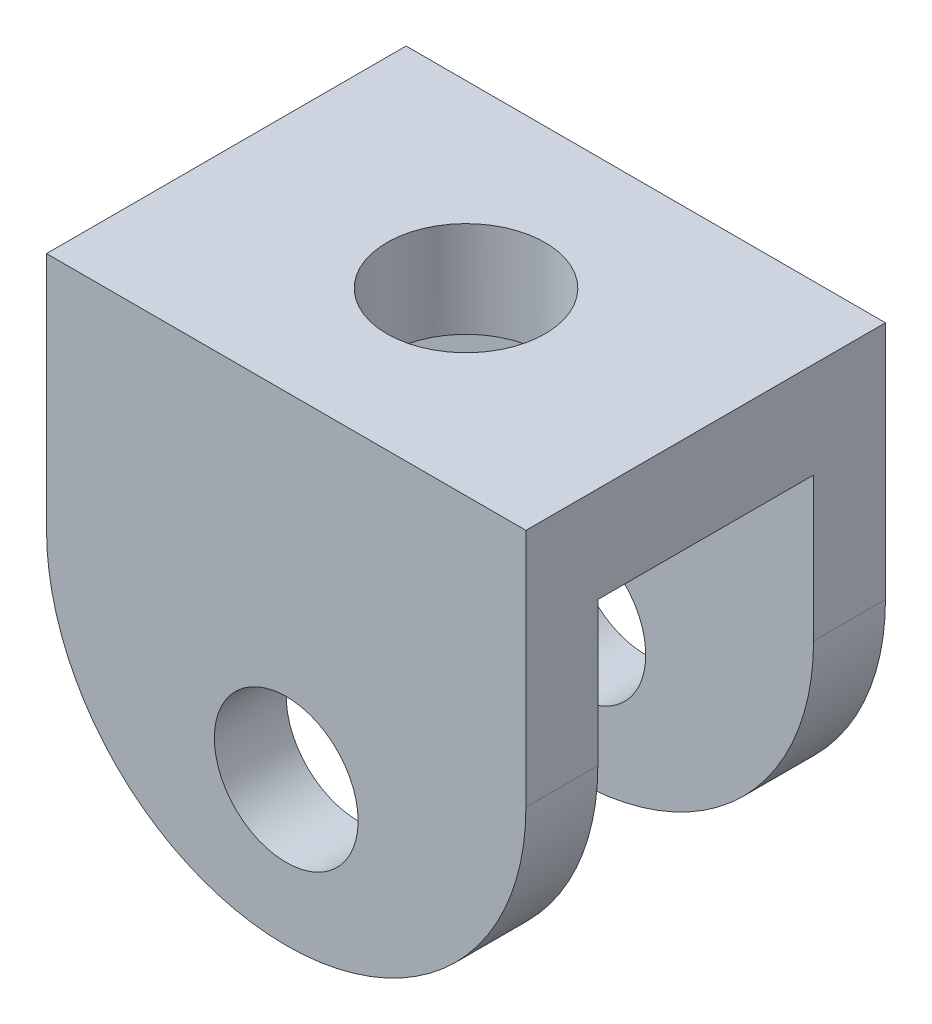
ISO-10303-21;
HEADER;
FILE_DESCRIPTION(('STEP AP214'),'2;1');
FILE_NAME('part.step','',(''),(''),'','','');
FILE_SCHEMA(('AUTOMOTIVE_DESIGN { 1 0 10303 214 1 1 1 1 }'));
ENDSEC;
DATA;
#1=APPLICATION_CONTEXT('core data for automotive mechanical design processes');
#2=APPLICATION_PROTOCOL_DEFINITION('international standard','automotive_design',2000,#1);
#3=PRODUCT_CONTEXT('',#1,'mechanical');
#4=PRODUCT('Part','Part','',(#3));
#5=PRODUCT_RELATED_PRODUCT_CATEGORY('part','',(#4));
#6=PRODUCT_DEFINITION_FORMATION('','',#4);
#7=PRODUCT_DEFINITION_CONTEXT('part definition',#1,'design');
#8=PRODUCT_DEFINITION('design','',#6,#7);
#9=PRODUCT_DEFINITION_SHAPE('','',#8);
#10=(LENGTH_UNIT() NAMED_UNIT(*) SI_UNIT(.MILLI.,.METRE.));
#11=(NAMED_UNIT(*) PLANE_ANGLE_UNIT() SI_UNIT($,.RADIAN.));
#12=(NAMED_UNIT(*) SI_UNIT($,.STERADIAN.) SOLID_ANGLE_UNIT());
#13=UNCERTAINTY_MEASURE_WITH_UNIT(LENGTH_MEASURE(1.E-05),#10,'distance_accuracy_value','');
#14=(GEOMETRIC_REPRESENTATION_CONTEXT(3) GLOBAL_UNCERTAINTY_ASSIGNED_CONTEXT((#13)) GLOBAL_UNIT_ASSIGNED_CONTEXT((#10,
#11,#12)) REPRESENTATION_CONTEXT('',''));
#15=CARTESIAN_POINT('',(0.,0.,0.));
#16=DIRECTION('',(0.,0.,1.));
#17=DIRECTION('',(1.,0.,0.));
#18=AXIS2_PLACEMENT_3D('',#15,#16,#17);
#19=CARTESIAN_POINT('',(0.,0.,0.));
#20=DIRECTION('',(0.,-1.,0.));
#21=DIRECTION('',(0.,0.,-1.));
#22=AXIS2_PLACEMENT_3D('',#19,#20,#21);
#23=PLANE('',#22);
#24=CARTESIAN_POINT('',(0.,0.,0.));
#25=DIRECTION('',(0.,-1.,0.));
#26=DIRECTION('',(0.,0.,-1.));
#27=AXIS2_PLACEMENT_3D('',#24,#25,#26);
#28=CIRCLE('',#27,3.3);
#29=CARTESIAN_POINT('',(0.,0.,-3.3));
#30=VERTEX_POINT('',#29);
#31=EDGE_CURVE('E138',#30,#30,#28,.T.);
#32=ORIENTED_EDGE('',*,*,#31,.F.);
#33=EDGE_LOOP('',(#32));
#34=FACE_BOUND('',#33,.T.);
#35=DIRECTION('',(0.,0.,-1.));
#36=VECTOR('',#35,1.);
#37=CARTESIAN_POINT('',(10.,0.,7.5));
#38=LINE('',#37,#36);
#39=CARTESIAN_POINT('',(10.,0.,4.5));
#40=VERTEX_POINT('',#39);
#41=CARTESIAN_POINT('',(10.,0.,-4.5));
#42=VERTEX_POINT('',#41);
#43=EDGE_CURVE('E123',#40,#42,#38,.T.);
#44=ORIENTED_EDGE('',*,*,#43,.F.);
#45=DIRECTION('',(1.,0.,0.));
#46=VECTOR('',#45,1.);
#47=CARTESIAN_POINT('',(10.,0.,4.5));
#48=LINE('',#47,#46);
#49=CARTESIAN_POINT('',(-10.,0.,4.5));
#50=VERTEX_POINT('',#49);
#51=EDGE_CURVE('E130',#50,#40,#48,.T.);
#52=ORIENTED_EDGE('',*,*,#51,.F.);
#53=DIRECTION('',(0.,0.,1.));
#54=VECTOR('',#53,1.);
#55=CARTESIAN_POINT('',(-10.,0.,7.5));
#56=LINE('',#55,#54);
#57=CARTESIAN_POINT('',(-10.,0.,-4.5));
#58=VERTEX_POINT('',#57);
#59=EDGE_CURVE('E143',#58,#50,#56,.T.);
#60=ORIENTED_EDGE('',*,*,#59,.F.);
#61=DIRECTION('',(-1.,0.,0.));
#62=VECTOR('',#61,1.);
#63=CARTESIAN_POINT('',(-10.,0.,-4.5));
#64=LINE('',#63,#62);
#65=EDGE_CURVE('E141',#42,#58,#64,.T.);
#66=ORIENTED_EDGE('',*,*,#65,.F.);
#67=EDGE_LOOP('',(#44,#52,#60,#66));
#68=FACE_BOUND('',#67,.T.);
#69=ADVANCED_FACE('F41',(#34,#68),#23,.T.);
#70=CARTESIAN_POINT('',(10.,4.,7.5));
#71=DIRECTION('',(-1.,0.,0.));
#72=DIRECTION('',(0.,0.,1.));
#73=AXIS2_PLACEMENT_3D('',#70,#71,#72);
#74=PLANE('',#73);
#75=DIRECTION('',(0.,1.,0.));
#76=VECTOR('',#75,1.);
#77=CARTESIAN_POINT('',(10.,-16.,-4.5));
#78=LINE('',#77,#76);
#79=CARTESIAN_POINT('',(10.,-6.,-4.5));
#80=VERTEX_POINT('',#79);
#81=EDGE_CURVE('E144',#80,#42,#78,.T.);
#82=ORIENTED_EDGE('',*,*,#81,.F.);
#83=DIRECTION('',(0.,0.,1.));
#84=VECTOR('',#83,1.);
#85=CARTESIAN_POINT('',(10.,-6.,7.5));
#86=LINE('',#85,#84);
#87=CARTESIAN_POINT('',(10.,-6.,-7.5));
#88=VERTEX_POINT('',#87);
#89=EDGE_CURVE('E185',#80,#88,#86,.F.);
#90=ORIENTED_EDGE('',*,*,#89,.T.);
#91=DIRECTION('',(0.,-1.,0.));
#92=VECTOR('',#91,1.);
#93=CARTESIAN_POINT('',(10.,4.,-7.5));
#94=LINE('',#93,#92);
#95=CARTESIAN_POINT('',(10.,4.,-7.5));
#96=VERTEX_POINT('',#95);
#97=EDGE_CURVE('E167',#96,#88,#94,.T.);
#98=ORIENTED_EDGE('',*,*,#97,.F.);
#99=DIRECTION('',(0.,0.,-1.));
#100=VECTOR('',#99,1.);
#101=CARTESIAN_POINT('',(10.,4.,7.5));
#102=LINE('',#101,#100);
#103=CARTESIAN_POINT('',(10.,4.,7.5));
#104=VERTEX_POINT('',#103);
#105=EDGE_CURVE('E148',#104,#96,#102,.T.);
#106=ORIENTED_EDGE('',*,*,#105,.F.);
#107=DIRECTION('',(0.,-1.,0.));
#108=VECTOR('',#107,1.);
#109=CARTESIAN_POINT('',(10.,4.,7.5));
#110=LINE('',#109,#108);
#111=CARTESIAN_POINT('',(10.,-6.,7.5));
#112=VERTEX_POINT('',#111);
#113=EDGE_CURVE('E156',#104,#112,#110,.T.);
#114=ORIENTED_EDGE('',*,*,#113,.T.);
#115=DIRECTION('',(0.,0.,1.));
#116=VECTOR('',#115,1.);
#117=CARTESIAN_POINT('',(10.,-6.,7.5));
#118=LINE('',#117,#116);
#119=CARTESIAN_POINT('',(10.,-6.,4.5));
#120=VERTEX_POINT('',#119);
#121=EDGE_CURVE('E127',#112,#120,#118,.F.);
#122=ORIENTED_EDGE('',*,*,#121,.T.);
#123=DIRECTION('',(0.,1.,0.));
#124=VECTOR('',#123,1.);
#125=CARTESIAN_POINT('',(10.,-16.,4.5));
#126=LINE('',#125,#124);
#127=EDGE_CURVE('E118',#120,#40,#126,.T.);
#128=ORIENTED_EDGE('',*,*,#127,.T.);
#129=ORIENTED_EDGE('',*,*,#43,.T.);
#130=EDGE_LOOP('',(#82,#90,#98,#106,#114,#122,#128,#129));
#131=FACE_BOUND('',#130,.T.);
#132=ADVANCED_FACE('F121',(#131),#74,.F.);
#133=CARTESIAN_POINT('',(-10.,4.,-7.5));
#134=DIRECTION('',(0.,0.,1.));
#135=DIRECTION('',(1.,0.,0.));
#136=AXIS2_PLACEMENT_3D('',#133,#134,#135);
#137=PLANE('',#136);
#138=CARTESIAN_POINT('',(0.,-10.,-7.5));
#139=DIRECTION('',(0.,0.,1.));
#140=DIRECTION('',(1.,0.,0.));
#141=AXIS2_PLACEMENT_3D('',#138,#139,#140);
#142=CIRCLE('',#141,3.);
#143=CARTESIAN_POINT('',(3.,-10.,-7.5));
#144=VERTEX_POINT('',#143);
#145=EDGE_CURVE('E209',#144,#144,#142,.T.);
#146=ORIENTED_EDGE('',*,*,#145,.T.);
#147=EDGE_LOOP('',(#146));
#148=FACE_BOUND('',#147,.T.);
#149=ORIENTED_EDGE('',*,*,#97,.T.);
#150=CARTESIAN_POINT('',(0.,-6.,-7.5));
#151=DIRECTION('',(0.,0.,1.));
#152=DIRECTION('',(1.,0.,0.));
#153=AXIS2_PLACEMENT_3D('',#150,#151,#152);
#154=CIRCLE('',#153,10.);
#155=CARTESIAN_POINT('',(0.,-16.,-7.5));
#156=VERTEX_POINT('',#155);
#157=EDGE_CURVE('E192',#88,#156,#154,.F.);
#158=ORIENTED_EDGE('',*,*,#157,.T.);
#159=CARTESIAN_POINT('',(0.,-6.,-7.5));
#160=DIRECTION('',(0.,0.,1.));
#161=DIRECTION('',(1.,0.,0.));
#162=AXIS2_PLACEMENT_3D('',#159,#160,#161);
#163=CIRCLE('',#162,10.);
#164=CARTESIAN_POINT('',(-10.,-6.,-7.5));
#165=VERTEX_POINT('',#164);
#166=EDGE_CURVE('E189',#156,#165,#163,.F.);
#167=ORIENTED_EDGE('',*,*,#166,.T.);
#168=DIRECTION('',(0.,-1.,0.));
#169=VECTOR('',#168,1.);
#170=CARTESIAN_POINT('',(-10.,4.,-7.5));
#171=LINE('',#170,#169);
#172=CARTESIAN_POINT('',(-10.,4.,-7.5));
#173=VERTEX_POINT('',#172);
#174=EDGE_CURVE('E163',#173,#165,#171,.T.);
#175=ORIENTED_EDGE('',*,*,#174,.F.);
#176=DIRECTION('',(-1.,0.,0.));
#177=VECTOR('',#176,1.);
#178=CARTESIAN_POINT('',(-10.,4.,-7.5));
#179=LINE('',#178,#177);
#180=EDGE_CURVE('E239',#96,#173,#179,.T.);
#181=ORIENTED_EDGE('',*,*,#180,.F.);
#182=EDGE_LOOP('',(#149,#158,#167,#175,#181));
#183=FACE_BOUND('',#182,.T.);
#184=ADVANCED_FACE('F278',(#148,#183),#137,.F.);
#185=CARTESIAN_POINT('',(-10.,4.,7.5));
#186=DIRECTION('',(1.,0.,0.));
#187=DIRECTION('',(0.,0.,-1.));
#188=AXIS2_PLACEMENT_3D('',#185,#186,#187);
#189=PLANE('',#188);
#190=DIRECTION('',(0.,1.,0.));
#191=VECTOR('',#190,1.);
#192=CARTESIAN_POINT('',(-10.,-16.,4.5));
#193=LINE('',#192,#191);
#194=CARTESIAN_POINT('',(-10.,-6.,4.5));
#195=VERTEX_POINT('',#194);
#196=EDGE_CURVE('E129',#195,#50,#193,.T.);
#197=ORIENTED_EDGE('',*,*,#196,.F.);
#198=DIRECTION('',(0.,0.,-1.));
#199=VECTOR('',#198,1.);
#200=CARTESIAN_POINT('',(-10.,-6.,7.5));
#201=LINE('',#200,#199);
#202=CARTESIAN_POINT('',(-10.,-6.,7.5));
#203=VERTEX_POINT('',#202);
#204=EDGE_CURVE('E11',#195,#203,#201,.F.);
#205=ORIENTED_EDGE('',*,*,#204,.T.);
#206=DIRECTION('',(0.,-1.,0.));
#207=VECTOR('',#206,1.);
#208=CARTESIAN_POINT('',(-10.,4.,7.5));
#209=LINE('',#208,#207);
#210=CARTESIAN_POINT('',(-10.,4.,7.5));
#211=VERTEX_POINT('',#210);
#212=EDGE_CURVE('E159',#211,#203,#209,.T.);
#213=ORIENTED_EDGE('',*,*,#212,.F.);
#214=DIRECTION('',(0.,0.,1.));
#215=VECTOR('',#214,1.);
#216=CARTESIAN_POINT('',(-10.,4.,7.5));
#217=LINE('',#216,#215);
#218=EDGE_CURVE('E237',#173,#211,#217,.T.);
#219=ORIENTED_EDGE('',*,*,#218,.F.);
#220=ORIENTED_EDGE('',*,*,#174,.T.);
#221=DIRECTION('',(0.,0.,-1.));
#222=VECTOR('',#221,1.);
#223=CARTESIAN_POINT('',(-10.,-6.,7.5));
#224=LINE('',#223,#222);
#225=CARTESIAN_POINT('',(-10.,-6.,-4.5));
#226=VERTEX_POINT('',#225);
#227=EDGE_CURVE('E51',#165,#226,#224,.F.);
#228=ORIENTED_EDGE('',*,*,#227,.T.);
#229=DIRECTION('',(0.,1.,0.));
#230=VECTOR('',#229,1.);
#231=CARTESIAN_POINT('',(-10.,-16.,-4.5));
#232=LINE('',#231,#230);
#233=EDGE_CURVE('E150',#226,#58,#232,.T.);
#234=ORIENTED_EDGE('',*,*,#233,.T.);
#235=ORIENTED_EDGE('',*,*,#59,.T.);
#236=EDGE_LOOP('',(#197,#205,#213,#219,#220,#228,#234,#235));
#237=FACE_BOUND('',#236,.T.);
#238=ADVANCED_FACE('F227',(#237),#189,.F.);
#239=CARTESIAN_POINT('',(-10.,4.,7.5));
#240=DIRECTION('',(0.,0.,-1.));
#241=DIRECTION('',(-1.,0.,0.));
#242=AXIS2_PLACEMENT_3D('',#239,#240,#241);
#243=PLANE('',#242);
#244=CARTESIAN_POINT('',(0.,-10.,7.5));
#245=DIRECTION('',(0.,0.,1.));
#246=DIRECTION('',(1.,0.,0.));
#247=AXIS2_PLACEMENT_3D('',#244,#245,#246);
#248=CIRCLE('',#247,3.);
#249=CARTESIAN_POINT('',(3.,-10.,7.5));
#250=VERTEX_POINT('',#249);
#251=EDGE_CURVE('E177',#250,#250,#248,.T.);
#252=ORIENTED_EDGE('',*,*,#251,.F.);
#253=EDGE_LOOP('',(#252));
#254=FACE_BOUND('',#253,.T.);
#255=CARTESIAN_POINT('',(0.,-6.,7.5));
#256=DIRECTION('',(0.,0.,-1.));
#257=DIRECTION('',(-1.,0.,0.));
#258=AXIS2_PLACEMENT_3D('',#255,#256,#257);
#259=CIRCLE('',#258,10.);
#260=CARTESIAN_POINT('',(0.,-16.,7.5));
#261=VERTEX_POINT('',#260);
#262=EDGE_CURVE('E195',#203,#261,#259,.F.);
#263=ORIENTED_EDGE('',*,*,#262,.T.);
#264=CARTESIAN_POINT('',(0.,-6.,7.5));
#265=DIRECTION('',(0.,0.,-1.));
#266=DIRECTION('',(-1.,0.,0.));
#267=AXIS2_PLACEMENT_3D('',#264,#265,#266);
#268=CIRCLE('',#267,10.);
#269=EDGE_CURVE('E198',#261,#112,#268,.F.);
#270=ORIENTED_EDGE('',*,*,#269,.T.);
#271=ORIENTED_EDGE('',*,*,#113,.F.);
#272=DIRECTION('',(1.,0.,0.));
#273=VECTOR('',#272,1.);
#274=CARTESIAN_POINT('',(-10.,4.,7.5));
#275=LINE('',#274,#273);
#276=EDGE_CURVE('E153',#211,#104,#275,.T.);
#277=ORIENTED_EDGE('',*,*,#276,.F.);
#278=ORIENTED_EDGE('',*,*,#212,.T.);
#279=EDGE_LOOP('',(#263,#270,#271,#277,#278));
#280=FACE_BOUND('',#279,.T.);
#281=ADVANCED_FACE('F231',(#254,#280),#243,.F.);
#282=CARTESIAN_POINT('',(0.,4.,0.));
#283=DIRECTION('',(0.,-1.,0.));
#284=DIRECTION('',(0.,0.,-1.));
#285=AXIS2_PLACEMENT_3D('',#282,#283,#284);
#286=PLANE('',#285);
#287=CARTESIAN_POINT('',(0.,4.,0.));
#288=DIRECTION('',(0.,1.,0.));
#289=DIRECTION('',(0.,0.,1.));
#290=AXIS2_PLACEMENT_3D('',#287,#288,#289);
#291=CIRCLE('',#290,3.3);
#292=CARTESIAN_POINT('',(0.,4.,3.3));
#293=VERTEX_POINT('',#292);
#294=EDGE_CURVE('E254',#293,#293,#291,.T.);
#295=ORIENTED_EDGE('',*,*,#294,.F.);
#296=EDGE_LOOP('',(#295));
#297=FACE_BOUND('',#296,.T.);
#298=ORIENTED_EDGE('',*,*,#105,.T.);
#299=ORIENTED_EDGE('',*,*,#180,.T.);
#300=ORIENTED_EDGE('',*,*,#218,.T.);
#301=ORIENTED_EDGE('',*,*,#276,.T.);
#302=EDGE_LOOP('',(#298,#299,#300,#301));
#303=FACE_BOUND('',#302,.T.);
#304=ADVANCED_FACE('F269',(#297,#303),#286,.F.);
#305=CARTESIAN_POINT('',(-10.,-16.,-4.5));
#306=DIRECTION('',(0.,0.,-1.));
#307=DIRECTION('',(-1.,0.,0.));
#308=AXIS2_PLACEMENT_3D('',#305,#306,#307);
#309=PLANE('',#308);
#310=CARTESIAN_POINT('',(0.,-10.,-4.5));
#311=DIRECTION('',(0.,0.,-1.));
#312=DIRECTION('',(-1.,0.,0.));
#313=AXIS2_PLACEMENT_3D('',#310,#311,#312);
#314=CIRCLE('',#313,3.);
#315=CARTESIAN_POINT('',(-3.,-10.,-4.5));
#316=VERTEX_POINT('',#315);
#317=EDGE_CURVE('E176',#316,#316,#314,.F.);
#318=ORIENTED_EDGE('',*,*,#317,.F.);
#319=EDGE_LOOP('',(#318));
#320=FACE_BOUND('',#319,.T.);
#321=CARTESIAN_POINT('',(0.,-6.,-4.5));
#322=DIRECTION('',(0.,0.,-1.));
#323=DIRECTION('',(-1.,0.,0.));
#324=AXIS2_PLACEMENT_3D('',#321,#322,#323);
#325=CIRCLE('',#324,10.);
#326=CARTESIAN_POINT('',(0.,-16.,-4.5));
#327=VERTEX_POINT('',#326);
#328=EDGE_CURVE('E171',#226,#327,#325,.F.);
#329=ORIENTED_EDGE('',*,*,#328,.T.);
#330=CARTESIAN_POINT('',(0.,-6.,-4.5));
#331=DIRECTION('',(0.,0.,-1.));
#332=DIRECTION('',(-1.,0.,0.));
#333=AXIS2_PLACEMENT_3D('',#330,#331,#332);
#334=CIRCLE('',#333,10.);
#335=EDGE_CURVE('E180',#327,#80,#334,.F.);
#336=ORIENTED_EDGE('',*,*,#335,.T.);
#337=ORIENTED_EDGE('',*,*,#81,.T.);
#338=ORIENTED_EDGE('',*,*,#65,.T.);
#339=ORIENTED_EDGE('',*,*,#233,.F.);
#340=EDGE_LOOP('',(#329,#336,#337,#338,#339));
#341=FACE_BOUND('',#340,.T.);
#342=ADVANCED_FACE('F275',(#320,#341),#309,.F.);
#343=CARTESIAN_POINT('',(10.,-16.,4.5));
#344=DIRECTION('',(0.,0.,1.));
#345=DIRECTION('',(1.,0.,0.));
#346=AXIS2_PLACEMENT_3D('',#343,#344,#345);
#347=PLANE('',#346);
#348=CARTESIAN_POINT('',(0.,-10.,4.5));
#349=DIRECTION('',(0.,0.,1.));
#350=DIRECTION('',(1.,0.,0.));
#351=AXIS2_PLACEMENT_3D('',#348,#349,#350);
#352=CIRCLE('',#351,3.);
#353=CARTESIAN_POINT('',(3.,-10.,4.5));
#354=VERTEX_POINT('',#353);
#355=EDGE_CURVE('E172',#354,#354,#352,.F.);
#356=ORIENTED_EDGE('',*,*,#355,.F.);
#357=EDGE_LOOP('',(#356));
#358=FACE_BOUND('',#357,.T.);
#359=ORIENTED_EDGE('',*,*,#127,.F.);
#360=CARTESIAN_POINT('',(0.,-6.,4.5));
#361=DIRECTION('',(0.,0.,1.));
#362=DIRECTION('',(1.,0.,0.));
#363=AXIS2_PLACEMENT_3D('',#360,#361,#362);
#364=CIRCLE('',#363,10.);
#365=CARTESIAN_POINT('',(0.,-16.,4.5));
#366=VERTEX_POINT('',#365);
#367=EDGE_CURVE('E64',#120,#366,#364,.F.);
#368=ORIENTED_EDGE('',*,*,#367,.T.);
#369=CARTESIAN_POINT('',(0.,-6.,4.5));
#370=DIRECTION('',(0.,0.,1.));
#371=DIRECTION('',(1.,0.,0.));
#372=AXIS2_PLACEMENT_3D('',#369,#370,#371);
#373=CIRCLE('',#372,10.);
#374=EDGE_CURVE('E59',#366,#195,#373,.F.);
#375=ORIENTED_EDGE('',*,*,#374,.T.);
#376=ORIENTED_EDGE('',*,*,#196,.T.);
#377=ORIENTED_EDGE('',*,*,#51,.T.);
#378=EDGE_LOOP('',(#359,#368,#375,#376,#377));
#379=FACE_BOUND('',#378,.T.);
#380=ADVANCED_FACE('F133',(#358,#379),#347,.F.);
#381=CARTESIAN_POINT('',(0.,4.,0.));
#382=DIRECTION('',(0.,1.,0.));
#383=DIRECTION('',(0.,0.,1.));
#384=AXIS2_PLACEMENT_3D('',#381,#382,#383);
#385=CYLINDRICAL_SURFACE('',#384,3.3);
#386=ORIENTED_EDGE('',*,*,#31,.T.);
#387=EDGE_LOOP('',(#386));
#388=FACE_BOUND('',#387,.T.);
#389=ORIENTED_EDGE('',*,*,#294,.T.);
#390=EDGE_LOOP('',(#389));
#391=FACE_BOUND('',#390,.T.);
#392=ADVANCED_FACE('F294',(#388,#391),#385,.F.);
#393=CARTESIAN_POINT('',(0.,-10.,7.5));
#394=DIRECTION('',(0.,0.,-1.));
#395=DIRECTION('',(-1.,0.,0.));
#396=AXIS2_PLACEMENT_3D('',#393,#394,#395);
#397=CYLINDRICAL_SURFACE('',#396,3.);
#398=ORIENTED_EDGE('',*,*,#251,.T.);
#399=EDGE_LOOP('',(#398));
#400=FACE_BOUND('',#399,.T.);
#401=ORIENTED_EDGE('',*,*,#355,.T.);
#402=EDGE_LOOP('',(#401));
#403=FACE_BOUND('',#402,.T.);
#404=ADVANCED_FACE('F265',(#400,#403),#397,.F.);
#405=ORIENTED_EDGE('',*,*,#145,.F.);
#406=EDGE_LOOP('',(#405));
#407=FACE_BOUND('',#406,.T.);
#408=ORIENTED_EDGE('',*,*,#317,.T.);
#409=EDGE_LOOP('',(#408));
#410=FACE_BOUND('',#409,.T.);
#411=ADVANCED_FACE('F299',(#407,#410),#397,.F.);
#412=CARTESIAN_POINT('',(0.,-6.,0.));
#413=DIRECTION('',(0.,0.,-1.));
#414=DIRECTION('',(-1.,0.,0.));
#415=AXIS2_PLACEMENT_3D('',#412,#413,#414);
#416=CYLINDRICAL_SURFACE('',#415,10.);
#417=ORIENTED_EDGE('',*,*,#227,.F.);
#418=ORIENTED_EDGE('',*,*,#166,.F.);
#419=DIRECTION('',(0.,0.,-1.));
#420=VECTOR('',#419,1.);
#421=CARTESIAN_POINT('',(0.,-16.,0.));
#422=LINE('',#421,#420);
#423=EDGE_CURVE('E206',#327,#156,#422,.T.);
#424=ORIENTED_EDGE('',*,*,#423,.F.);
#425=ORIENTED_EDGE('',*,*,#328,.F.);
#426=EDGE_LOOP('',(#417,#418,#424,#425));
#427=FACE_BOUND('',#426,.T.);
#428=ADVANCED_FACE('F301',(#427),#416,.T.);
#429=CARTESIAN_POINT('',(0.,-6.,0.));
#430=DIRECTION('',(0.,0.,1.));
#431=DIRECTION('',(1.,0.,0.));
#432=AXIS2_PLACEMENT_3D('',#429,#430,#431);
#433=CYLINDRICAL_SURFACE('',#432,10.);
#434=ORIENTED_EDGE('',*,*,#157,.F.);
#435=ORIENTED_EDGE('',*,*,#89,.F.);
#436=ORIENTED_EDGE('',*,*,#335,.F.);
#437=ORIENTED_EDGE('',*,*,#423,.T.);
#438=EDGE_LOOP('',(#434,#435,#436,#437));
#439=FACE_BOUND('',#438,.T.);
#440=ADVANCED_FACE('F307',(#439),#433,.T.);
#441=CARTESIAN_POINT('',(0.,-6.,0.));
#442=DIRECTION('',(0.,0.,-1.));
#443=DIRECTION('',(-1.,0.,0.));
#444=AXIS2_PLACEMENT_3D('',#441,#442,#443);
#445=CYLINDRICAL_SURFACE('',#444,10.);
#446=ORIENTED_EDGE('',*,*,#204,.F.);
#447=ORIENTED_EDGE('',*,*,#374,.F.);
#448=DIRECTION('',(0.,0.,-1.));
#449=VECTOR('',#448,1.);
#450=CARTESIAN_POINT('',(0.,-16.,0.));
#451=LINE('',#450,#449);
#452=EDGE_CURVE('E45',#261,#366,#451,.T.);
#453=ORIENTED_EDGE('',*,*,#452,.F.);
#454=ORIENTED_EDGE('',*,*,#262,.F.);
#455=EDGE_LOOP('',(#446,#447,#453,#454));
#456=FACE_BOUND('',#455,.T.);
#457=ADVANCED_FACE('F43',(#456),#445,.T.);
#458=CARTESIAN_POINT('',(0.,-6.,0.));
#459=DIRECTION('',(0.,0.,1.));
#460=DIRECTION('',(1.,0.,0.));
#461=AXIS2_PLACEMENT_3D('',#458,#459,#460);
#462=CYLINDRICAL_SURFACE('',#461,10.);
#463=ORIENTED_EDGE('',*,*,#367,.F.);
#464=ORIENTED_EDGE('',*,*,#121,.F.);
#465=ORIENTED_EDGE('',*,*,#269,.F.);
#466=ORIENTED_EDGE('',*,*,#452,.T.);
#467=EDGE_LOOP('',(#463,#464,#465,#466));
#468=FACE_BOUND('',#467,.T.);
#469=ADVANCED_FACE('F221',(#468),#462,.T.);
#470=CLOSED_SHELL('',(#69,#132,#184,#238,#281,#304,#342,#380,#392,#404,#411,#428,#440,#457,#469));
#471=MANIFOLD_SOLID_BREP('B2',#470);
#472=ADVANCED_BREP_SHAPE_REPRESENTATION('',(#18,#471),#14);
#473=SHAPE_DEFINITION_REPRESENTATION(#9,#472);
ENDSEC;
END-ISO-10303-21;
